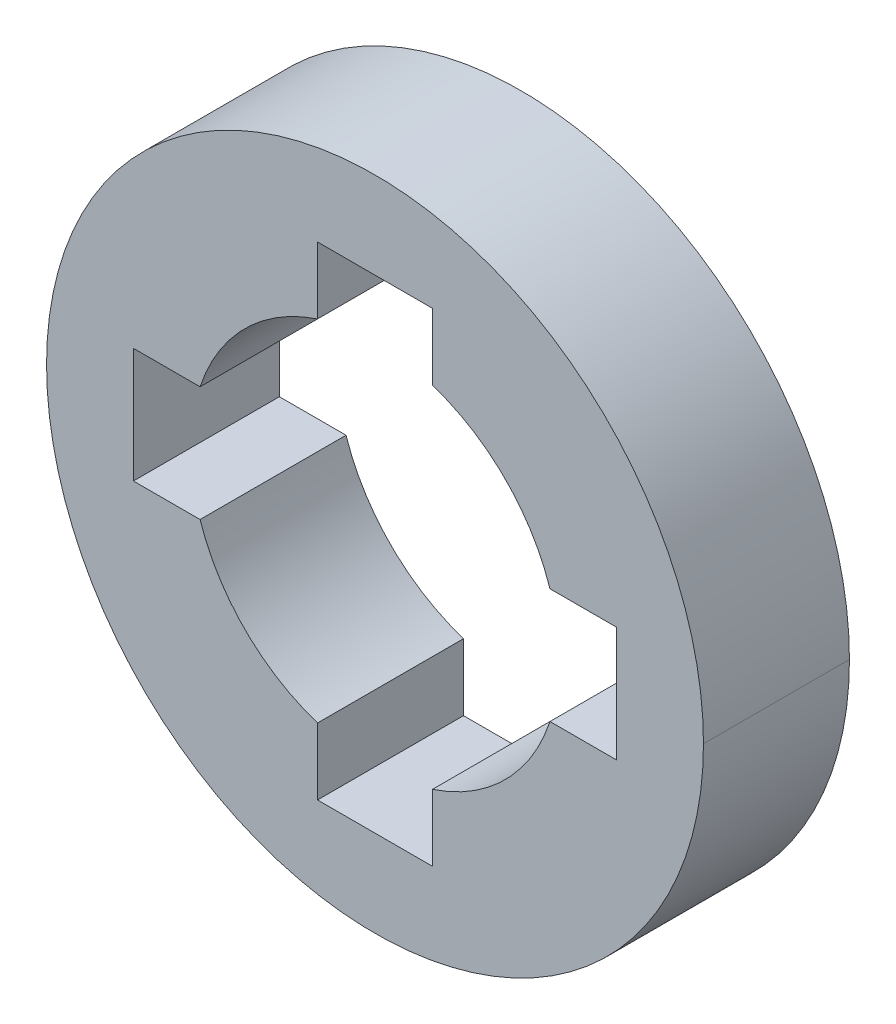
ISO-10303-21;
HEADER;
FILE_DESCRIPTION(('STEP AP214'),'2;1');
FILE_NAME('part.step','',(''),(''),'','','');
FILE_SCHEMA(('AUTOMOTIVE_DESIGN { 1 0 10303 214 1 1 1 1 }'));
ENDSEC;
DATA;
#1=APPLICATION_CONTEXT('core data for automotive mechanical design processes');
#2=APPLICATION_PROTOCOL_DEFINITION('international standard','automotive_design',2000,#1);
#3=PRODUCT_CONTEXT('',#1,'mechanical');
#4=PRODUCT('Part','Part','',(#3));
#5=PRODUCT_RELATED_PRODUCT_CATEGORY('part','',(#4));
#6=PRODUCT_DEFINITION_FORMATION('','',#4);
#7=PRODUCT_DEFINITION_CONTEXT('part definition',#1,'design');
#8=PRODUCT_DEFINITION('design','',#6,#7);
#9=PRODUCT_DEFINITION_SHAPE('','',#8);
#10=(LENGTH_UNIT() NAMED_UNIT(*) SI_UNIT(.MILLI.,.METRE.));
#11=(NAMED_UNIT(*) PLANE_ANGLE_UNIT() SI_UNIT($,.RADIAN.));
#12=(NAMED_UNIT(*) SI_UNIT($,.STERADIAN.) SOLID_ANGLE_UNIT());
#13=UNCERTAINTY_MEASURE_WITH_UNIT(LENGTH_MEASURE(1.E-05),#10,'distance_accuracy_value','');
#14=(GEOMETRIC_REPRESENTATION_CONTEXT(3) GLOBAL_UNCERTAINTY_ASSIGNED_CONTEXT((#13)) GLOBAL_UNIT_ASSIGNED_CONTEXT((#10,
#11,#12)) REPRESENTATION_CONTEXT('',''));
#15=CARTESIAN_POINT('',(0.,0.,0.));
#16=DIRECTION('',(0.,0.,1.));
#17=DIRECTION('',(1.,0.,0.));
#18=AXIS2_PLACEMENT_3D('',#15,#16,#17);
#19=CARTESIAN_POINT('',(0.,0.,-1.5875));
#20=DIRECTION('',(0.,0.,1.));
#21=DIRECTION('',(1.,0.,0.));
#22=AXIS2_PLACEMENT_3D('',#19,#20,#21);
#23=PLANE('',#22);
#24=CARTESIAN_POINT('',(0.,0.,-1.5875));
#25=DIRECTION('',(0.,0.,1.));
#26=DIRECTION('',(1.,0.,0.));
#27=AXIS2_PLACEMENT_3D('',#24,#25,#26);
#28=CIRCLE('',#27,4.005);
#29=CARTESIAN_POINT('',(3.80493429641038,1.25,-1.5875));
#30=VERTEX_POINT('',#29);
#31=CARTESIAN_POINT('',(1.25,3.80493429641038,-1.5875));
#32=VERTEX_POINT('',#31);
#33=EDGE_CURVE('E322',#30,#32,#28,.T.);
#34=ORIENTED_EDGE('',*,*,#33,.T.);
#35=DIRECTION('',(0.,-1.,0.));
#36=VECTOR('',#35,1.);
#37=CARTESIAN_POINT('',(1.25,0.,-1.5875));
#38=LINE('',#37,#36);
#39=CARTESIAN_POINT('',(1.25,5.255,-1.5875));
#40=VERTEX_POINT('',#39);
#41=EDGE_CURVE('E253',#40,#32,#38,.T.);
#42=ORIENTED_EDGE('',*,*,#41,.F.);
#43=DIRECTION('',(1.,0.,0.));
#44=VECTOR('',#43,1.);
#45=CARTESIAN_POINT('',(0.,5.255,-1.5875));
#46=LINE('',#45,#44);
#47=CARTESIAN_POINT('',(-1.25,5.255,-1.5875));
#48=VERTEX_POINT('',#47);
#49=EDGE_CURVE('E20',#48,#40,#46,.T.);
#50=ORIENTED_EDGE('',*,*,#49,.F.);
#51=DIRECTION('',(0.,-1.,0.));
#52=VECTOR('',#51,1.);
#53=CARTESIAN_POINT('',(-1.25,0.,-1.5875));
#54=LINE('',#53,#52);
#55=CARTESIAN_POINT('',(-1.25,3.80493429641038,-1.5875));
#56=VERTEX_POINT('',#55);
#57=EDGE_CURVE('E239',#48,#56,#54,.T.);
#58=ORIENTED_EDGE('',*,*,#57,.T.);
#59=CARTESIAN_POINT('',(0.,0.,-1.5875));
#60=DIRECTION('',(0.,0.,1.));
#61=DIRECTION('',(1.,0.,0.));
#62=AXIS2_PLACEMENT_3D('',#59,#60,#61);
#63=CIRCLE('',#62,4.005);
#64=CARTESIAN_POINT('',(-3.80493429641038,1.25,-1.5875));
#65=VERTEX_POINT('',#64);
#66=EDGE_CURVE('E278',#56,#65,#63,.T.);
#67=ORIENTED_EDGE('',*,*,#66,.T.);
#68=DIRECTION('',(1.,0.,0.));
#69=VECTOR('',#68,1.);
#70=CARTESIAN_POINT('',(0.,1.25,-1.5875));
#71=LINE('',#70,#69);
#72=CARTESIAN_POINT('',(-5.255,1.25,-1.5875));
#73=VERTEX_POINT('',#72);
#74=EDGE_CURVE('E231',#73,#65,#71,.T.);
#75=ORIENTED_EDGE('',*,*,#74,.F.);
#76=DIRECTION('',(0.,-1.,0.));
#77=VECTOR('',#76,1.);
#78=CARTESIAN_POINT('',(-5.255,0.,-1.5875));
#79=LINE('',#78,#77);
#80=CARTESIAN_POINT('',(-5.255,-1.25,-1.5875));
#81=VERTEX_POINT('',#80);
#82=EDGE_CURVE('E293',#73,#81,#79,.T.);
#83=ORIENTED_EDGE('',*,*,#82,.T.);
#84=DIRECTION('',(1.,0.,0.));
#85=VECTOR('',#84,1.);
#86=CARTESIAN_POINT('',(0.,-1.25,-1.5875));
#87=LINE('',#86,#85);
#88=CARTESIAN_POINT('',(-3.80493429641038,-1.25,-1.5875));
#89=VERTEX_POINT('',#88);
#90=EDGE_CURVE('E153',#81,#89,#87,.T.);
#91=ORIENTED_EDGE('',*,*,#90,.T.);
#92=CARTESIAN_POINT('',(0.,0.,-1.5875));
#93=DIRECTION('',(0.,0.,1.));
#94=DIRECTION('',(1.,0.,0.));
#95=AXIS2_PLACEMENT_3D('',#92,#93,#94);
#96=CIRCLE('',#95,4.005);
#97=CARTESIAN_POINT('',(-1.25,-3.80493429641038,-1.5875));
#98=VERTEX_POINT('',#97);
#99=EDGE_CURVE('E274',#89,#98,#96,.T.);
#100=ORIENTED_EDGE('',*,*,#99,.T.);
#101=DIRECTION('',(0.,-1.,0.));
#102=VECTOR('',#101,1.);
#103=CARTESIAN_POINT('',(-1.25,0.,-1.5875));
#104=LINE('',#103,#102);
#105=CARTESIAN_POINT('',(-1.25,-5.255,-1.5875));
#106=VERTEX_POINT('',#105);
#107=EDGE_CURVE('E259',#98,#106,#104,.T.);
#108=ORIENTED_EDGE('',*,*,#107,.T.);
#109=DIRECTION('',(1.,0.,0.));
#110=VECTOR('',#109,1.);
#111=CARTESIAN_POINT('',(0.,-5.255,-1.5875));
#112=LINE('',#111,#110);
#113=CARTESIAN_POINT('',(1.25,-5.255,-1.5875));
#114=VERTEX_POINT('',#113);
#115=EDGE_CURVE('E300',#106,#114,#112,.T.);
#116=ORIENTED_EDGE('',*,*,#115,.T.);
#117=DIRECTION('',(0.,-1.,0.));
#118=VECTOR('',#117,1.);
#119=CARTESIAN_POINT('',(1.25,0.,-1.5875));
#120=LINE('',#119,#118);
#121=CARTESIAN_POINT('',(1.25,-3.80493429641038,-1.5875));
#122=VERTEX_POINT('',#121);
#123=EDGE_CURVE('E249',#122,#114,#120,.T.);
#124=ORIENTED_EDGE('',*,*,#123,.F.);
#125=CARTESIAN_POINT('',(0.,0.,-1.5875));
#126=DIRECTION('',(0.,0.,1.));
#127=DIRECTION('',(1.,0.,0.));
#128=AXIS2_PLACEMENT_3D('',#125,#126,#127);
#129=CIRCLE('',#128,4.005);
#130=CARTESIAN_POINT('',(3.80493429641038,-1.25,-1.5875));
#131=VERTEX_POINT('',#130);
#132=EDGE_CURVE('E241',#122,#131,#129,.T.);
#133=ORIENTED_EDGE('',*,*,#132,.T.);
#134=DIRECTION('',(1.,0.,0.));
#135=VECTOR('',#134,1.);
#136=CARTESIAN_POINT('',(0.,-1.25,-1.5875));
#137=LINE('',#136,#135);
#138=CARTESIAN_POINT('',(5.255,-1.25,-1.5875));
#139=VERTEX_POINT('',#138);
#140=EDGE_CURVE('E358',#131,#139,#137,.T.);
#141=ORIENTED_EDGE('',*,*,#140,.T.);
#142=DIRECTION('',(0.,-1.,0.));
#143=VECTOR('',#142,1.);
#144=CARTESIAN_POINT('',(5.255,0.,-1.5875));
#145=LINE('',#144,#143);
#146=CARTESIAN_POINT('',(5.255,1.25,-1.5875));
#147=VERTEX_POINT('',#146);
#148=EDGE_CURVE('E308',#147,#139,#145,.T.);
#149=ORIENTED_EDGE('',*,*,#148,.F.);
#150=DIRECTION('',(1.,0.,0.));
#151=VECTOR('',#150,1.);
#152=CARTESIAN_POINT('',(0.,1.25,-1.5875));
#153=LINE('',#152,#151);
#154=EDGE_CURVE('E219',#30,#147,#153,.T.);
#155=ORIENTED_EDGE('',*,*,#154,.F.);
#156=EDGE_LOOP('',(#34,#42,#50,#58,#67,#75,#83,#91,#100,#108,#116,#124,#133,#141,#149,#155));
#157=FACE_BOUND('',#156,.T.);
#158=CARTESIAN_POINT('',(0.,0.,-1.5875));
#159=DIRECTION('',(0.,0.,1.));
#160=DIRECTION('',(1.,0.,0.));
#161=AXIS2_PLACEMENT_3D('',#158,#159,#160);
#162=CIRCLE('',#161,7.14375);
#163=CARTESIAN_POINT('',(-7.14375,0.,-1.5875));
#164=VERTEX_POINT('',#163);
#165=CARTESIAN_POINT('',(7.14375,0.,-1.5875));
#166=VERTEX_POINT('',#165);
#167=EDGE_CURVE('E11',#164,#166,#162,.T.);
#168=ORIENTED_EDGE('',*,*,#167,.F.);
#169=CARTESIAN_POINT('',(0.,0.,-1.5875));
#170=DIRECTION('',(0.,0.,1.));
#171=DIRECTION('',(1.,0.,0.));
#172=AXIS2_PLACEMENT_3D('',#169,#170,#171);
#173=CIRCLE('',#172,7.14375);
#174=EDGE_CURVE('E203',#166,#164,#173,.T.);
#175=ORIENTED_EDGE('',*,*,#174,.F.);
#176=EDGE_LOOP('',(#168,#175));
#177=FACE_BOUND('',#176,.T.);
#178=ADVANCED_FACE('F16',(#157,#177),#23,.F.);
#179=CARTESIAN_POINT('',(0.,0.,1.5875));
#180=DIRECTION('',(0.,0.,1.));
#181=DIRECTION('',(1.,0.,0.));
#182=AXIS2_PLACEMENT_3D('',#179,#180,#181);
#183=PLANE('',#182);
#184=CARTESIAN_POINT('',(0.,0.,1.5875));
#185=DIRECTION('',(0.,0.,1.));
#186=DIRECTION('',(1.,0.,0.));
#187=AXIS2_PLACEMENT_3D('',#184,#185,#186);
#188=CIRCLE('',#187,4.005);
#189=CARTESIAN_POINT('',(3.80493429641038,1.25,1.5875));
#190=VERTEX_POINT('',#189);
#191=CARTESIAN_POINT('',(1.25,3.80493429641038,1.5875));
#192=VERTEX_POINT('',#191);
#193=EDGE_CURVE('E221',#190,#192,#188,.T.);
#194=ORIENTED_EDGE('',*,*,#193,.F.);
#195=DIRECTION('',(1.,0.,0.));
#196=VECTOR('',#195,1.);
#197=CARTESIAN_POINT('',(0.,1.25,1.5875));
#198=LINE('',#197,#196);
#199=CARTESIAN_POINT('',(5.255,1.25,1.5875));
#200=VERTEX_POINT('',#199);
#201=EDGE_CURVE('E290',#190,#200,#198,.T.);
#202=ORIENTED_EDGE('',*,*,#201,.T.);
#203=DIRECTION('',(0.,-1.,0.));
#204=VECTOR('',#203,1.);
#205=CARTESIAN_POINT('',(5.255,0.,1.5875));
#206=LINE('',#205,#204);
#207=CARTESIAN_POINT('',(5.255,-1.25,1.5875));
#208=VERTEX_POINT('',#207);
#209=EDGE_CURVE('E338',#200,#208,#206,.T.);
#210=ORIENTED_EDGE('',*,*,#209,.T.);
#211=DIRECTION('',(1.,0.,0.));
#212=VECTOR('',#211,1.);
#213=CARTESIAN_POINT('',(0.,-1.25,1.5875));
#214=LINE('',#213,#212);
#215=CARTESIAN_POINT('',(3.80493429641038,-1.25,1.5875));
#216=VERTEX_POINT('',#215);
#217=EDGE_CURVE('E245',#216,#208,#214,.T.);
#218=ORIENTED_EDGE('',*,*,#217,.F.);
#219=CARTESIAN_POINT('',(0.,0.,1.5875));
#220=DIRECTION('',(0.,0.,1.));
#221=DIRECTION('',(1.,0.,0.));
#222=AXIS2_PLACEMENT_3D('',#219,#220,#221);
#223=CIRCLE('',#222,4.005);
#224=CARTESIAN_POINT('',(1.25,-3.80493429641038,1.5875));
#225=VERTEX_POINT('',#224);
#226=EDGE_CURVE('E246',#225,#216,#223,.T.);
#227=ORIENTED_EDGE('',*,*,#226,.F.);
#228=DIRECTION('',(0.,-1.,0.));
#229=VECTOR('',#228,1.);
#230=CARTESIAN_POINT('',(1.25,0.,1.5875));
#231=LINE('',#230,#229);
#232=CARTESIAN_POINT('',(1.25,-5.255,1.5875));
#233=VERTEX_POINT('',#232);
#234=EDGE_CURVE('E304',#225,#233,#231,.T.);
#235=ORIENTED_EDGE('',*,*,#234,.T.);
#236=DIRECTION('',(1.,0.,0.));
#237=VECTOR('',#236,1.);
#238=CARTESIAN_POINT('',(0.,-5.255,1.5875));
#239=LINE('',#238,#237);
#240=CARTESIAN_POINT('',(-1.25,-5.255,1.5875));
#241=VERTEX_POINT('',#240);
#242=EDGE_CURVE('E266',#241,#233,#239,.T.);
#243=ORIENTED_EDGE('',*,*,#242,.F.);
#244=DIRECTION('',(0.,-1.,0.));
#245=VECTOR('',#244,1.);
#246=CARTESIAN_POINT('',(-1.25,0.,1.5875));
#247=LINE('',#246,#245);
#248=CARTESIAN_POINT('',(-1.25,-3.80493429641038,1.5875));
#249=VERTEX_POINT('',#248);
#250=EDGE_CURVE('E258',#249,#241,#247,.T.);
#251=ORIENTED_EDGE('',*,*,#250,.F.);
#252=CARTESIAN_POINT('',(0.,0.,1.5875));
#253=DIRECTION('',(0.,0.,1.));
#254=DIRECTION('',(1.,0.,0.));
#255=AXIS2_PLACEMENT_3D('',#252,#253,#254);
#256=CIRCLE('',#255,4.005);
#257=CARTESIAN_POINT('',(-3.80493429641038,-1.25,1.5875));
#258=VERTEX_POINT('',#257);
#259=EDGE_CURVE('E167',#258,#249,#256,.T.);
#260=ORIENTED_EDGE('',*,*,#259,.F.);
#261=DIRECTION('',(1.,0.,0.));
#262=VECTOR('',#261,1.);
#263=CARTESIAN_POINT('',(0.,-1.25,1.5875));
#264=LINE('',#263,#262);
#265=CARTESIAN_POINT('',(-5.255,-1.25,1.5875));
#266=VERTEX_POINT('',#265);
#267=EDGE_CURVE('E299',#266,#258,#264,.T.);
#268=ORIENTED_EDGE('',*,*,#267,.F.);
#269=DIRECTION('',(0.,-1.,0.));
#270=VECTOR('',#269,1.);
#271=CARTESIAN_POINT('',(-5.255,0.,1.5875));
#272=LINE('',#271,#270);
#273=CARTESIAN_POINT('',(-5.255,1.25,1.5875));
#274=VERTEX_POINT('',#273);
#275=EDGE_CURVE('E263',#274,#266,#272,.T.);
#276=ORIENTED_EDGE('',*,*,#275,.F.);
#277=DIRECTION('',(1.,0.,0.));
#278=VECTOR('',#277,1.);
#279=CARTESIAN_POINT('',(0.,1.25,1.5875));
#280=LINE('',#279,#278);
#281=CARTESIAN_POINT('',(-3.80493429641038,1.25,1.5875));
#282=VERTEX_POINT('',#281);
#283=EDGE_CURVE('E230',#274,#282,#280,.T.);
#284=ORIENTED_EDGE('',*,*,#283,.T.);
#285=CARTESIAN_POINT('',(0.,0.,1.5875));
#286=DIRECTION('',(0.,0.,1.));
#287=DIRECTION('',(1.,0.,0.));
#288=AXIS2_PLACEMENT_3D('',#285,#286,#287);
#289=CIRCLE('',#288,4.005);
#290=CARTESIAN_POINT('',(-1.25,3.80493429641038,1.5875));
#291=VERTEX_POINT('',#290);
#292=EDGE_CURVE('E236',#291,#282,#289,.T.);
#293=ORIENTED_EDGE('',*,*,#292,.F.);
#294=DIRECTION('',(0.,-1.,0.));
#295=VECTOR('',#294,1.);
#296=CARTESIAN_POINT('',(-1.25,0.,1.5875));
#297=LINE('',#296,#295);
#298=CARTESIAN_POINT('',(-1.25,5.255,1.5875));
#299=VERTEX_POINT('',#298);
#300=EDGE_CURVE('E232',#299,#291,#297,.T.);
#301=ORIENTED_EDGE('',*,*,#300,.F.);
#302=DIRECTION('',(1.,0.,0.));
#303=VECTOR('',#302,1.);
#304=CARTESIAN_POINT('',(0.,5.255,1.5875));
#305=LINE('',#304,#303);
#306=CARTESIAN_POINT('',(1.25,5.255,1.5875));
#307=VERTEX_POINT('',#306);
#308=EDGE_CURVE('E250',#299,#307,#305,.T.);
#309=ORIENTED_EDGE('',*,*,#308,.T.);
#310=DIRECTION('',(0.,-1.,0.));
#311=VECTOR('',#310,1.);
#312=CARTESIAN_POINT('',(1.25,0.,1.5875));
#313=LINE('',#312,#311);
#314=EDGE_CURVE('E42',#307,#192,#313,.T.);
#315=ORIENTED_EDGE('',*,*,#314,.T.);
#316=EDGE_LOOP('',(#194,#202,#210,#218,#227,#235,#243,#251,#260,#268,#276,#284,#293,#301,#309,#315));
#317=FACE_BOUND('',#316,.T.);
#318=CARTESIAN_POINT('',(0.,0.,1.5875));
#319=DIRECTION('',(0.,0.,1.));
#320=DIRECTION('',(1.,0.,0.));
#321=AXIS2_PLACEMENT_3D('',#318,#319,#320);
#322=CIRCLE('',#321,7.14375);
#323=CARTESIAN_POINT('',(-7.14375,0.,1.5875));
#324=VERTEX_POINT('',#323);
#325=CARTESIAN_POINT('',(7.14375,0.,1.5875));
#326=VERTEX_POINT('',#325);
#327=EDGE_CURVE('E27',#324,#326,#322,.T.);
#328=ORIENTED_EDGE('',*,*,#327,.T.);
#329=CARTESIAN_POINT('',(0.,0.,1.5875));
#330=DIRECTION('',(0.,0.,1.));
#331=DIRECTION('',(1.,0.,0.));
#332=AXIS2_PLACEMENT_3D('',#329,#330,#331);
#333=CIRCLE('',#332,7.14375);
#334=EDGE_CURVE('E208',#326,#324,#333,.T.);
#335=ORIENTED_EDGE('',*,*,#334,.T.);
#336=EDGE_LOOP('',(#328,#335));
#337=FACE_BOUND('',#336,.T.);
#338=ADVANCED_FACE('F616',(#317,#337),#183,.T.);
#339=CARTESIAN_POINT('',(0.,0.,1.5875));
#340=DIRECTION('',(0.,0.,-1.));
#341=DIRECTION('',(-1.,0.,0.));
#342=AXIS2_PLACEMENT_3D('',#339,#340,#341);
#343=CYLINDRICAL_SURFACE('',#342,7.14375);
#344=DIRECTION('',(0.,0.,-1.));
#345=VECTOR('',#344,1.);
#346=CARTESIAN_POINT('',(7.14375,0.,1.5875));
#347=LINE('',#346,#345);
#348=EDGE_CURVE('E197',#326,#166,#347,.T.);
#349=ORIENTED_EDGE('',*,*,#348,.F.);
#350=ORIENTED_EDGE('',*,*,#327,.F.);
#351=DIRECTION('',(0.,0.,-1.));
#352=VECTOR('',#351,1.);
#353=CARTESIAN_POINT('',(-7.14375,0.,1.5875));
#354=LINE('',#353,#352);
#355=EDGE_CURVE('E200',#324,#164,#354,.T.);
#356=ORIENTED_EDGE('',*,*,#355,.T.);
#357=ORIENTED_EDGE('',*,*,#167,.T.);
#358=EDGE_LOOP('',(#349,#350,#356,#357));
#359=FACE_BOUND('',#358,.T.);
#360=ADVANCED_FACE('F195',(#359),#343,.T.);
#361=CARTESIAN_POINT('',(1.25,0.,1.5875));
#362=DIRECTION('',(1.,0.,0.));
#363=DIRECTION('',(0.,1.,0.));
#364=AXIS2_PLACEMENT_3D('',#361,#362,#363);
#365=PLANE('',#364);
#366=ORIENTED_EDGE('',*,*,#41,.T.);
#367=DIRECTION('',(0.,0.,-1.));
#368=VECTOR('',#367,1.);
#369=CARTESIAN_POINT('',(1.25,3.80493429641038,1.5875));
#370=LINE('',#369,#368);
#371=EDGE_CURVE('E224',#192,#32,#370,.T.);
#372=ORIENTED_EDGE('',*,*,#371,.F.);
#373=ORIENTED_EDGE('',*,*,#314,.F.);
#374=DIRECTION('',(0.,0.,-1.));
#375=VECTOR('',#374,1.);
#376=CARTESIAN_POINT('',(1.25,5.255,1.5875));
#377=LINE('',#376,#375);
#378=EDGE_CURVE('E254',#307,#40,#377,.T.);
#379=ORIENTED_EDGE('',*,*,#378,.T.);
#380=EDGE_LOOP('',(#366,#372,#373,#379));
#381=FACE_BOUND('',#380,.T.);
#382=ADVANCED_FACE('F635',(#381),#365,.F.);
#383=CARTESIAN_POINT('',(0.,5.255,1.5875));
#384=DIRECTION('',(0.,1.,0.));
#385=DIRECTION('',(1.,0.,0.));
#386=AXIS2_PLACEMENT_3D('',#383,#384,#385);
#387=PLANE('',#386);
#388=ORIENTED_EDGE('',*,*,#49,.T.);
#389=ORIENTED_EDGE('',*,*,#378,.F.);
#390=ORIENTED_EDGE('',*,*,#308,.F.);
#391=DIRECTION('',(0.,0.,-1.));
#392=VECTOR('',#391,1.);
#393=CARTESIAN_POINT('',(-1.25,5.255,1.5875));
#394=LINE('',#393,#392);
#395=EDGE_CURVE('E235',#299,#48,#394,.T.);
#396=ORIENTED_EDGE('',*,*,#395,.T.);
#397=EDGE_LOOP('',(#388,#389,#390,#396));
#398=FACE_BOUND('',#397,.T.);
#399=ADVANCED_FACE('F660',(#398),#387,.F.);
#400=CARTESIAN_POINT('',(-1.25,0.,1.5875));
#401=DIRECTION('',(1.,0.,0.));
#402=DIRECTION('',(0.,1.,0.));
#403=AXIS2_PLACEMENT_3D('',#400,#401,#402);
#404=PLANE('',#403);
#405=ORIENTED_EDGE('',*,*,#57,.F.);
#406=ORIENTED_EDGE('',*,*,#395,.F.);
#407=ORIENTED_EDGE('',*,*,#300,.T.);
#408=DIRECTION('',(0.,0.,-1.));
#409=VECTOR('',#408,1.);
#410=CARTESIAN_POINT('',(-1.25,3.80493429641038,1.5875));
#411=LINE('',#410,#409);
#412=EDGE_CURVE('E240',#291,#56,#411,.T.);
#413=ORIENTED_EDGE('',*,*,#412,.T.);
#414=EDGE_LOOP('',(#405,#406,#407,#413));
#415=FACE_BOUND('',#414,.T.);
#416=ADVANCED_FACE('F651',(#415),#404,.T.);
#417=CARTESIAN_POINT('',(0.,0.,1.5875));
#418=DIRECTION('',(0.,0.,-1.));
#419=DIRECTION('',(-1.,0.,0.));
#420=AXIS2_PLACEMENT_3D('',#417,#418,#419);
#421=CYLINDRICAL_SURFACE('',#420,4.005);
#422=ORIENTED_EDGE('',*,*,#66,.F.);
#423=ORIENTED_EDGE('',*,*,#412,.F.);
#424=ORIENTED_EDGE('',*,*,#292,.T.);
#425=DIRECTION('',(0.,0.,-1.));
#426=VECTOR('',#425,1.);
#427=CARTESIAN_POINT('',(-3.80493429641038,1.25,1.5875));
#428=LINE('',#427,#426);
#429=EDGE_CURVE('E226',#282,#65,#428,.T.);
#430=ORIENTED_EDGE('',*,*,#429,.T.);
#431=EDGE_LOOP('',(#422,#423,#424,#430));
#432=FACE_BOUND('',#431,.T.);
#433=ADVANCED_FACE('F647',(#432),#421,.F.);
#434=CARTESIAN_POINT('',(0.,1.25,1.5875));
#435=DIRECTION('',(0.,1.,0.));
#436=DIRECTION('',(1.,0.,0.));
#437=AXIS2_PLACEMENT_3D('',#434,#435,#436);
#438=PLANE('',#437);
#439=ORIENTED_EDGE('',*,*,#74,.T.);
#440=ORIENTED_EDGE('',*,*,#429,.F.);
#441=ORIENTED_EDGE('',*,*,#283,.F.);
#442=DIRECTION('',(0.,0.,-1.));
#443=VECTOR('',#442,1.);
#444=CARTESIAN_POINT('',(-5.255,1.25,1.5875));
#445=LINE('',#444,#443);
#446=EDGE_CURVE('E281',#274,#73,#445,.T.);
#447=ORIENTED_EDGE('',*,*,#446,.T.);
#448=EDGE_LOOP('',(#439,#440,#441,#447));
#449=FACE_BOUND('',#448,.T.);
#450=ADVANCED_FACE('F18',(#449),#438,.F.);
#451=CARTESIAN_POINT('',(-5.255,0.,1.5875));
#452=DIRECTION('',(1.,0.,0.));
#453=DIRECTION('',(0.,1.,0.));
#454=AXIS2_PLACEMENT_3D('',#451,#452,#453);
#455=PLANE('',#454);
#456=ORIENTED_EDGE('',*,*,#82,.F.);
#457=ORIENTED_EDGE('',*,*,#446,.F.);
#458=ORIENTED_EDGE('',*,*,#275,.T.);
#459=DIRECTION('',(0.,0.,-1.));
#460=VECTOR('',#459,1.);
#461=CARTESIAN_POINT('',(-5.255,-1.25,1.5875));
#462=LINE('',#461,#460);
#463=EDGE_CURVE('E295',#266,#81,#462,.T.);
#464=ORIENTED_EDGE('',*,*,#463,.T.);
#465=EDGE_LOOP('',(#456,#457,#458,#464));
#466=FACE_BOUND('',#465,.T.);
#467=ADVANCED_FACE('F385',(#466),#455,.T.);
#468=CARTESIAN_POINT('',(0.,-1.25,1.5875));
#469=DIRECTION('',(0.,1.,0.));
#470=DIRECTION('',(1.,0.,0.));
#471=AXIS2_PLACEMENT_3D('',#468,#469,#470);
#472=PLANE('',#471);
#473=ORIENTED_EDGE('',*,*,#90,.F.);
#474=ORIENTED_EDGE('',*,*,#463,.F.);
#475=ORIENTED_EDGE('',*,*,#267,.T.);
#476=DIRECTION('',(0.,0.,-1.));
#477=VECTOR('',#476,1.);
#478=CARTESIAN_POINT('',(-3.80493429641038,-1.25,1.5875));
#479=LINE('',#478,#477);
#480=EDGE_CURVE('E271',#258,#89,#479,.T.);
#481=ORIENTED_EDGE('',*,*,#480,.T.);
#482=EDGE_LOOP('',(#473,#474,#475,#481));
#483=FACE_BOUND('',#482,.T.);
#484=ADVANCED_FACE('F389',(#483),#472,.T.);
#485=CARTESIAN_POINT('',(0.,0.,1.5875));
#486=DIRECTION('',(0.,0.,-1.));
#487=DIRECTION('',(-1.,0.,0.));
#488=AXIS2_PLACEMENT_3D('',#485,#486,#487);
#489=CYLINDRICAL_SURFACE('',#488,4.005);
#490=ORIENTED_EDGE('',*,*,#99,.F.);
#491=ORIENTED_EDGE('',*,*,#480,.F.);
#492=ORIENTED_EDGE('',*,*,#259,.T.);
#493=DIRECTION('',(0.,0.,-1.));
#494=VECTOR('',#493,1.);
#495=CARTESIAN_POINT('',(-1.25,-3.80493429641038,1.5875));
#496=LINE('',#495,#494);
#497=EDGE_CURVE('E255',#249,#98,#496,.T.);
#498=ORIENTED_EDGE('',*,*,#497,.T.);
#499=EDGE_LOOP('',(#490,#491,#492,#498));
#500=FACE_BOUND('',#499,.T.);
#501=ADVANCED_FACE('F391',(#500),#489,.F.);
#502=CARTESIAN_POINT('',(-1.25,0.,1.5875));
#503=DIRECTION('',(1.,0.,0.));
#504=DIRECTION('',(0.,1.,0.));
#505=AXIS2_PLACEMENT_3D('',#502,#503,#504);
#506=PLANE('',#505);
#507=ORIENTED_EDGE('',*,*,#107,.F.);
#508=ORIENTED_EDGE('',*,*,#497,.F.);
#509=ORIENTED_EDGE('',*,*,#250,.T.);
#510=DIRECTION('',(0.,0.,-1.));
#511=VECTOR('',#510,1.);
#512=CARTESIAN_POINT('',(-1.25,-5.255,1.5875));
#513=LINE('',#512,#511);
#514=EDGE_CURVE('E303',#241,#106,#513,.T.);
#515=ORIENTED_EDGE('',*,*,#514,.T.);
#516=EDGE_LOOP('',(#507,#508,#509,#515));
#517=FACE_BOUND('',#516,.T.);
#518=ADVANCED_FACE('F397',(#517),#506,.T.);
#519=CARTESIAN_POINT('',(0.,-5.255,1.5875));
#520=DIRECTION('',(0.,1.,0.));
#521=DIRECTION('',(1.,0.,0.));
#522=AXIS2_PLACEMENT_3D('',#519,#520,#521);
#523=PLANE('',#522);
#524=ORIENTED_EDGE('',*,*,#115,.F.);
#525=ORIENTED_EDGE('',*,*,#514,.F.);
#526=ORIENTED_EDGE('',*,*,#242,.T.);
#527=DIRECTION('',(0.,0.,-1.));
#528=VECTOR('',#527,1.);
#529=CARTESIAN_POINT('',(1.25,-5.255,1.5875));
#530=LINE('',#529,#528);
#531=EDGE_CURVE('E270',#233,#114,#530,.T.);
#532=ORIENTED_EDGE('',*,*,#531,.T.);
#533=EDGE_LOOP('',(#524,#525,#526,#532));
#534=FACE_BOUND('',#533,.T.);
#535=ADVANCED_FACE('F400',(#534),#523,.T.);
#536=CARTESIAN_POINT('',(1.25,0.,1.5875));
#537=DIRECTION('',(1.,0.,0.));
#538=DIRECTION('',(0.,1.,0.));
#539=AXIS2_PLACEMENT_3D('',#536,#537,#538);
#540=PLANE('',#539);
#541=ORIENTED_EDGE('',*,*,#123,.T.);
#542=ORIENTED_EDGE('',*,*,#531,.F.);
#543=ORIENTED_EDGE('',*,*,#234,.F.);
#544=DIRECTION('',(0.,0.,-1.));
#545=VECTOR('',#544,1.);
#546=CARTESIAN_POINT('',(1.25,-3.80493429641038,1.5875));
#547=LINE('',#546,#545);
#548=EDGE_CURVE('E244',#225,#122,#547,.T.);
#549=ORIENTED_EDGE('',*,*,#548,.T.);
#550=EDGE_LOOP('',(#541,#542,#543,#549));
#551=FACE_BOUND('',#550,.T.);
#552=ADVANCED_FACE('F403',(#551),#540,.F.);
#553=CARTESIAN_POINT('',(0.,0.,1.5875));
#554=DIRECTION('',(0.,0.,-1.));
#555=DIRECTION('',(-1.,0.,0.));
#556=AXIS2_PLACEMENT_3D('',#553,#554,#555);
#557=CYLINDRICAL_SURFACE('',#556,4.005);
#558=ORIENTED_EDGE('',*,*,#132,.F.);
#559=ORIENTED_EDGE('',*,*,#548,.F.);
#560=ORIENTED_EDGE('',*,*,#226,.T.);
#561=DIRECTION('',(0.,0.,-1.));
#562=VECTOR('',#561,1.);
#563=CARTESIAN_POINT('',(3.80493429641038,-1.25,1.5875));
#564=LINE('',#563,#562);
#565=EDGE_CURVE('E351',#216,#131,#564,.T.);
#566=ORIENTED_EDGE('',*,*,#565,.T.);
#567=EDGE_LOOP('',(#558,#559,#560,#566));
#568=FACE_BOUND('',#567,.T.);
#569=ADVANCED_FACE('F409',(#568),#557,.F.);
#570=CARTESIAN_POINT('',(0.,-1.25,1.5875));
#571=DIRECTION('',(0.,1.,0.));
#572=DIRECTION('',(1.,0.,0.));
#573=AXIS2_PLACEMENT_3D('',#570,#571,#572);
#574=PLANE('',#573);
#575=ORIENTED_EDGE('',*,*,#140,.F.);
#576=ORIENTED_EDGE('',*,*,#565,.F.);
#577=ORIENTED_EDGE('',*,*,#217,.T.);
#578=DIRECTION('',(0.,0.,-1.));
#579=VECTOR('',#578,1.);
#580=CARTESIAN_POINT('',(5.255,-1.25,1.5875));
#581=LINE('',#580,#579);
#582=EDGE_CURVE('E331',#208,#139,#581,.T.);
#583=ORIENTED_EDGE('',*,*,#582,.T.);
#584=EDGE_LOOP('',(#575,#576,#577,#583));
#585=FACE_BOUND('',#584,.T.);
#586=ADVANCED_FACE('F413',(#585),#574,.T.);
#587=CARTESIAN_POINT('',(5.255,0.,1.5875));
#588=DIRECTION('',(1.,0.,0.));
#589=DIRECTION('',(0.,1.,0.));
#590=AXIS2_PLACEMENT_3D('',#587,#588,#589);
#591=PLANE('',#590);
#592=ORIENTED_EDGE('',*,*,#148,.T.);
#593=ORIENTED_EDGE('',*,*,#582,.F.);
#594=ORIENTED_EDGE('',*,*,#209,.F.);
#595=DIRECTION('',(0.,0.,-1.));
#596=VECTOR('',#595,1.);
#597=CARTESIAN_POINT('',(5.255,1.25,1.5875));
#598=LINE('',#597,#596);
#599=EDGE_CURVE('E286',#200,#147,#598,.T.);
#600=ORIENTED_EDGE('',*,*,#599,.T.);
#601=EDGE_LOOP('',(#592,#593,#594,#600));
#602=FACE_BOUND('',#601,.T.);
#603=ADVANCED_FACE('F416',(#602),#591,.F.);
#604=CARTESIAN_POINT('',(0.,1.25,1.5875));
#605=DIRECTION('',(0.,1.,0.));
#606=DIRECTION('',(1.,0.,0.));
#607=AXIS2_PLACEMENT_3D('',#604,#605,#606);
#608=PLANE('',#607);
#609=ORIENTED_EDGE('',*,*,#154,.T.);
#610=ORIENTED_EDGE('',*,*,#599,.F.);
#611=ORIENTED_EDGE('',*,*,#201,.F.);
#612=DIRECTION('',(0.,0.,-1.));
#613=VECTOR('',#612,1.);
#614=CARTESIAN_POINT('',(3.80493429641038,1.25,1.5875));
#615=LINE('',#614,#613);
#616=EDGE_CURVE('E225',#190,#30,#615,.T.);
#617=ORIENTED_EDGE('',*,*,#616,.T.);
#618=EDGE_LOOP('',(#609,#610,#611,#617));
#619=FACE_BOUND('',#618,.T.);
#620=ADVANCED_FACE('F422',(#619),#608,.F.);
#621=CARTESIAN_POINT('',(0.,0.,1.5875));
#622=DIRECTION('',(0.,0.,-1.));
#623=DIRECTION('',(-1.,0.,0.));
#624=AXIS2_PLACEMENT_3D('',#621,#622,#623);
#625=CYLINDRICAL_SURFACE('',#624,4.005);
#626=ORIENTED_EDGE('',*,*,#33,.F.);
#627=ORIENTED_EDGE('',*,*,#616,.F.);
#628=ORIENTED_EDGE('',*,*,#193,.T.);
#629=ORIENTED_EDGE('',*,*,#371,.T.);
#630=EDGE_LOOP('',(#626,#627,#628,#629));
#631=FACE_BOUND('',#630,.T.);
#632=ADVANCED_FACE('F426',(#631),#625,.F.);
#633=CARTESIAN_POINT('',(0.,0.,1.5875));
#634=DIRECTION('',(0.,0.,-1.));
#635=DIRECTION('',(-1.,0.,0.));
#636=AXIS2_PLACEMENT_3D('',#633,#634,#635);
#637=CYLINDRICAL_SURFACE('',#636,7.14375);
#638=ORIENTED_EDGE('',*,*,#334,.F.);
#639=ORIENTED_EDGE('',*,*,#348,.T.);
#640=ORIENTED_EDGE('',*,*,#174,.T.);
#641=ORIENTED_EDGE('',*,*,#355,.F.);
#642=EDGE_LOOP('',(#638,#639,#640,#641));
#643=FACE_BOUND('',#642,.T.);
#644=ADVANCED_FACE('F206',(#643),#637,.T.);
#645=CLOSED_SHELL('',(#178,#338,#360,#382,#399,#416,#433,#450,#467,#484,#501,#518,#535,#552,
#569,#586,#603,#620,#632,#644));
#646=MANIFOLD_SOLID_BREP('B1',#645);
#647=ADVANCED_BREP_SHAPE_REPRESENTATION('',(#18,#646),#14);
#648=SHAPE_DEFINITION_REPRESENTATION(#9,#647);
ENDSEC;
END-ISO-10303-21;
